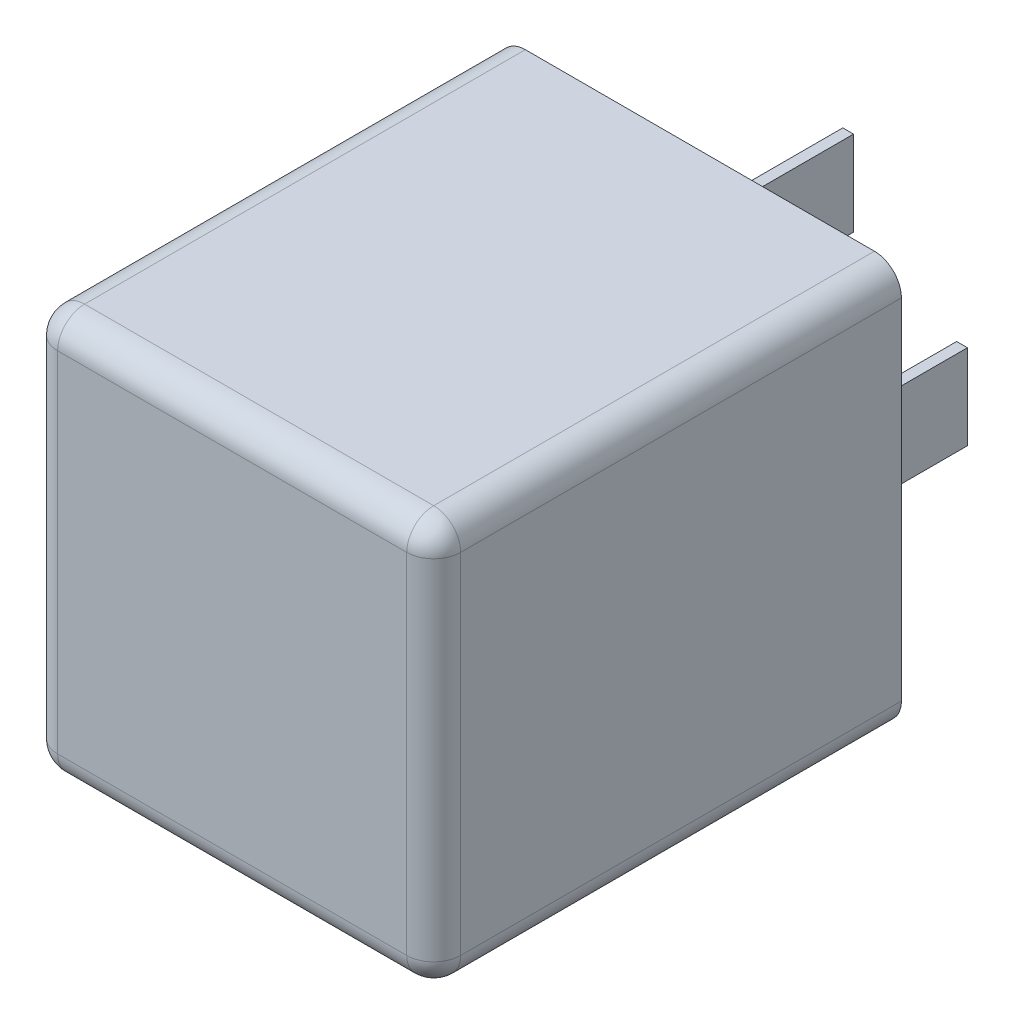
ISO-10303-21;
HEADER;
FILE_DESCRIPTION(('STEP AP214'),'2;1');
FILE_NAME('part.step','',(''),(''),'','','');
FILE_SCHEMA(('AUTOMOTIVE_DESIGN { 1 0 10303 214 1 1 1 1 }'));
ENDSEC;
DATA;
#1=APPLICATION_CONTEXT('core data for automotive mechanical design processes');
#2=APPLICATION_PROTOCOL_DEFINITION('international standard','automotive_design',2000,#1);
#3=PRODUCT_CONTEXT('',#1,'mechanical');
#4=PRODUCT('Part','Part','',(#3));
#5=PRODUCT_RELATED_PRODUCT_CATEGORY('part','',(#4));
#6=PRODUCT_DEFINITION_FORMATION('','',#4);
#7=PRODUCT_DEFINITION_CONTEXT('part definition',#1,'design');
#8=PRODUCT_DEFINITION('design','',#6,#7);
#9=PRODUCT_DEFINITION_SHAPE('','',#8);
#10=(LENGTH_UNIT() NAMED_UNIT(*) SI_UNIT(.MILLI.,.METRE.));
#11=(NAMED_UNIT(*) PLANE_ANGLE_UNIT() SI_UNIT($,.RADIAN.));
#12=(NAMED_UNIT(*) SI_UNIT($,.STERADIAN.) SOLID_ANGLE_UNIT());
#13=UNCERTAINTY_MEASURE_WITH_UNIT(LENGTH_MEASURE(1.E-05),#10,'distance_accuracy_value','');
#14=(GEOMETRIC_REPRESENTATION_CONTEXT(3) GLOBAL_UNCERTAINTY_ASSIGNED_CONTEXT((#13)) GLOBAL_UNIT_ASSIGNED_CONTEXT((#10,
#11,#12)) REPRESENTATION_CONTEXT('',''));
#15=CARTESIAN_POINT('',(0.,0.,0.));
#16=DIRECTION('',(0.,0.,1.));
#17=DIRECTION('',(1.,0.,0.));
#18=AXIS2_PLACEMENT_3D('',#15,#16,#17);
#19=CARTESIAN_POINT('',(12.95,12.95,-2.));
#20=DIRECTION('',(0.707106781186398,0.707106781186698,0.));
#21=DIRECTION('',(0.,0.,1.));
#22=AXIS2_PLACEMENT_3D('',#19,#20,#21);
#23=SPHERICAL_SURFACE('',#22,2.);
#24=CARTESIAN_POINT('',(12.95,12.95,-2.));
#25=DIRECTION('',(0.,0.,1.));
#26=DIRECTION('',(1.,0.,0.));
#27=AXIS2_PLACEMENT_3D('',#24,#25,#26);
#28=CIRCLE('',#27,2.);
#29=CARTESIAN_POINT('',(14.95,12.95,-2.));
#30=VERTEX_POINT('',#29);
#31=CARTESIAN_POINT('',(14.3642135623728,14.3642135623734,-2.));
#32=VERTEX_POINT('',#31);
#33=EDGE_CURVE('E19',#30,#32,#28,.T.);
#34=ORIENTED_EDGE('',*,*,#33,.T.);
#35=CARTESIAN_POINT('',(12.95,12.95,-2.));
#36=DIRECTION('',(0.,0.,1.));
#37=DIRECTION('',(0.707106781186398,0.707106781186698,0.));
#38=AXIS2_PLACEMENT_3D('',#35,#36,#37);
#39=CIRCLE('',#38,2.);
#40=CARTESIAN_POINT('',(12.95,14.95,-2.));
#41=VERTEX_POINT('',#40);
#42=EDGE_CURVE('E205',#32,#41,#39,.T.);
#43=ORIENTED_EDGE('',*,*,#42,.T.);
#44=CARTESIAN_POINT('',(12.95,12.95,-2.));
#45=DIRECTION('',(-1.,0.,0.));
#46=DIRECTION('',(0.,0.,1.));
#47=AXIS2_PLACEMENT_3D('',#44,#45,#46);
#48=CIRCLE('',#47,2.);
#49=CARTESIAN_POINT('',(12.95,12.95,0.));
#50=VERTEX_POINT('',#49);
#51=EDGE_CURVE('E211',#50,#41,#48,.T.);
#52=ORIENTED_EDGE('',*,*,#51,.F.);
#53=CARTESIAN_POINT('',(12.95,12.95,-2.));
#54=DIRECTION('',(0.,1.,0.));
#55=DIRECTION('',(0.,0.,1.));
#56=AXIS2_PLACEMENT_3D('',#53,#54,#55);
#57=CIRCLE('',#56,2.);
#58=EDGE_CURVE('E208',#30,#50,#57,.F.);
#59=ORIENTED_EDGE('',*,*,#58,.F.);
#60=EDGE_LOOP('',(#34,#43,#52,#59));
#61=FACE_BOUND('',#60,.T.);
#62=ADVANCED_FACE('F15',(#61),#23,.T.);
#63=CARTESIAN_POINT('',(-12.95,12.95,-2.));
#64=DIRECTION('',(-0.707106781186698,0.707106781186398,0.));
#65=DIRECTION('',(0.,0.,1.));
#66=AXIS2_PLACEMENT_3D('',#63,#64,#65);
#67=SPHERICAL_SURFACE('',#66,2.);
#68=CARTESIAN_POINT('',(-12.95,12.95,-2.));
#69=DIRECTION('',(0.,0.,1.));
#70=DIRECTION('',(1.,0.,0.));
#71=AXIS2_PLACEMENT_3D('',#68,#69,#70);
#72=CIRCLE('',#71,2.);
#73=CARTESIAN_POINT('',(-12.95,14.95,-2.));
#74=VERTEX_POINT('',#73);
#75=CARTESIAN_POINT('',(-14.3642135623734,14.3642135623728,-2.));
#76=VERTEX_POINT('',#75);
#77=EDGE_CURVE('E314',#74,#76,#72,.T.);
#78=ORIENTED_EDGE('',*,*,#77,.T.);
#79=CARTESIAN_POINT('',(-12.95,12.95,-2.));
#80=DIRECTION('',(0.,0.,1.));
#81=DIRECTION('',(-0.707106781186698,0.707106781186398,0.));
#82=AXIS2_PLACEMENT_3D('',#79,#80,#81);
#83=CIRCLE('',#82,2.);
#84=CARTESIAN_POINT('',(-14.95,12.95,-2.));
#85=VERTEX_POINT('',#84);
#86=EDGE_CURVE('E312',#76,#85,#83,.T.);
#87=ORIENTED_EDGE('',*,*,#86,.T.);
#88=CARTESIAN_POINT('',(-12.95,12.95,-2.));
#89=DIRECTION('',(0.,-1.,0.));
#90=DIRECTION('',(0.,0.,-1.));
#91=AXIS2_PLACEMENT_3D('',#88,#89,#90);
#92=CIRCLE('',#91,2.);
#93=CARTESIAN_POINT('',(-12.95,12.95,0.));
#94=VERTEX_POINT('',#93);
#95=EDGE_CURVE('E316',#94,#85,#92,.T.);
#96=ORIENTED_EDGE('',*,*,#95,.F.);
#97=CARTESIAN_POINT('',(-12.95,12.95,-2.));
#98=DIRECTION('',(-1.,0.,0.));
#99=DIRECTION('',(0.,0.,1.));
#100=AXIS2_PLACEMENT_3D('',#97,#98,#99);
#101=CIRCLE('',#100,2.);
#102=EDGE_CURVE('E317',#74,#94,#101,.F.);
#103=ORIENTED_EDGE('',*,*,#102,.F.);
#104=EDGE_LOOP('',(#78,#87,#96,#103));
#105=FACE_BOUND('',#104,.T.);
#106=ADVANCED_FACE('F297',(#105),#67,.T.);
#107=CARTESIAN_POINT('',(-12.95,-12.95,-2.));
#108=DIRECTION('',(-0.707106781186398,-0.707106781186698,0.));
#109=DIRECTION('',(0.,0.,1.));
#110=AXIS2_PLACEMENT_3D('',#107,#108,#109);
#111=SPHERICAL_SURFACE('',#110,2.);
#112=CARTESIAN_POINT('',(-12.95,-12.95,-2.));
#113=DIRECTION('',(0.,0.,1.));
#114=DIRECTION('',(1.,0.,0.));
#115=AXIS2_PLACEMENT_3D('',#112,#113,#114);
#116=CIRCLE('',#115,2.);
#117=CARTESIAN_POINT('',(-14.95,-12.95,-2.));
#118=VERTEX_POINT('',#117);
#119=CARTESIAN_POINT('',(-14.3642135623728,-14.3642135623734,-2.));
#120=VERTEX_POINT('',#119);
#121=EDGE_CURVE('E305',#118,#120,#116,.T.);
#122=ORIENTED_EDGE('',*,*,#121,.T.);
#123=CARTESIAN_POINT('',(-12.95,-12.95,-2.));
#124=DIRECTION('',(0.,0.,1.));
#125=DIRECTION('',(-0.707106781186398,-0.707106781186698,0.));
#126=AXIS2_PLACEMENT_3D('',#123,#124,#125);
#127=CIRCLE('',#126,2.);
#128=CARTESIAN_POINT('',(-12.95,-14.95,-2.));
#129=VERTEX_POINT('',#128);
#130=EDGE_CURVE('E302',#120,#129,#127,.T.);
#131=ORIENTED_EDGE('',*,*,#130,.T.);
#132=CARTESIAN_POINT('',(-12.95,-12.95,-2.));
#133=DIRECTION('',(1.,0.,0.));
#134=DIRECTION('',(0.,0.,-1.));
#135=AXIS2_PLACEMENT_3D('',#132,#133,#134);
#136=CIRCLE('',#135,2.);
#137=CARTESIAN_POINT('',(-12.95,-12.95,0.));
#138=VERTEX_POINT('',#137);
#139=EDGE_CURVE('E308',#138,#129,#136,.T.);
#140=ORIENTED_EDGE('',*,*,#139,.F.);
#141=CARTESIAN_POINT('',(-12.95,-12.95,-2.));
#142=DIRECTION('',(0.,-1.,0.));
#143=DIRECTION('',(0.,0.,-1.));
#144=AXIS2_PLACEMENT_3D('',#141,#142,#143);
#145=CIRCLE('',#144,2.);
#146=EDGE_CURVE('E309',#118,#138,#145,.F.);
#147=ORIENTED_EDGE('',*,*,#146,.F.);
#148=EDGE_LOOP('',(#122,#131,#140,#147));
#149=FACE_BOUND('',#148,.T.);
#150=ADVANCED_FACE('F292',(#149),#111,.T.);
#151=CARTESIAN_POINT('',(12.95,-12.95,-2.));
#152=DIRECTION('',(0.707106781186698,-0.707106781186398,0.));
#153=DIRECTION('',(0.,0.,1.));
#154=AXIS2_PLACEMENT_3D('',#151,#152,#153);
#155=SPHERICAL_SURFACE('',#154,2.);
#156=CARTESIAN_POINT('',(12.95,-12.95,-2.));
#157=DIRECTION('',(0.,0.,1.));
#158=DIRECTION('',(1.,0.,0.));
#159=AXIS2_PLACEMENT_3D('',#156,#157,#158);
#160=CIRCLE('',#159,2.);
#161=CARTESIAN_POINT('',(12.95,-14.95,-2.));
#162=VERTEX_POINT('',#161);
#163=CARTESIAN_POINT('',(14.3642135623734,-14.3642135623728,-2.));
#164=VERTEX_POINT('',#163);
#165=EDGE_CURVE('E304',#162,#164,#160,.T.);
#166=ORIENTED_EDGE('',*,*,#165,.T.);
#167=CARTESIAN_POINT('',(12.95,-12.95,-2.));
#168=DIRECTION('',(0.,0.,1.));
#169=DIRECTION('',(0.707106781186698,-0.707106781186398,0.));
#170=AXIS2_PLACEMENT_3D('',#167,#168,#169);
#171=CIRCLE('',#170,2.);
#172=CARTESIAN_POINT('',(14.95,-12.95,-2.));
#173=VERTEX_POINT('',#172);
#174=EDGE_CURVE('E284',#164,#173,#171,.T.);
#175=ORIENTED_EDGE('',*,*,#174,.T.);
#176=CARTESIAN_POINT('',(12.95,-12.95,-2.));
#177=DIRECTION('',(0.,1.,0.));
#178=DIRECTION('',(0.,0.,1.));
#179=AXIS2_PLACEMENT_3D('',#176,#177,#178);
#180=CIRCLE('',#179,2.);
#181=CARTESIAN_POINT('',(12.95,-12.95,0.));
#182=VERTEX_POINT('',#181);
#183=EDGE_CURVE('E215',#182,#173,#180,.T.);
#184=ORIENTED_EDGE('',*,*,#183,.F.);
#185=CARTESIAN_POINT('',(12.95,-12.95,-2.));
#186=DIRECTION('',(1.,0.,0.));
#187=DIRECTION('',(0.,0.,-1.));
#188=AXIS2_PLACEMENT_3D('',#185,#186,#187);
#189=CIRCLE('',#188,2.);
#190=EDGE_CURVE('E337',#162,#182,#189,.F.);
#191=ORIENTED_EDGE('',*,*,#190,.F.);
#192=EDGE_LOOP('',(#166,#175,#184,#191));
#193=FACE_BOUND('',#192,.T.);
#194=ADVANCED_FACE('F287',(#193),#155,.T.);
#195=CARTESIAN_POINT('',(0.,0.,0.));
#196=DIRECTION('',(0.,0.,1.));
#197=DIRECTION('',(1.,0.,0.));
#198=AXIS2_PLACEMENT_3D('',#195,#196,#197);
#199=PLANE('',#198);
#200=DIRECTION('',(1.,0.,0.));
#201=VECTOR('',#200,1.);
#202=CARTESIAN_POINT('',(-12.9653768,-12.95,0.));
#203=LINE('',#202,#201);
#204=EDGE_CURVE('E268',#182,#138,#203,.F.);
#205=ORIENTED_EDGE('',*,*,#204,.F.);
#206=DIRECTION('',(0.,1.,0.));
#207=VECTOR('',#206,1.);
#208=CARTESIAN_POINT('',(12.95,-12.9653768,0.));
#209=LINE('',#208,#207);
#210=EDGE_CURVE('E214',#50,#182,#209,.F.);
#211=ORIENTED_EDGE('',*,*,#210,.F.);
#212=DIRECTION('',(-1.,0.,0.));
#213=VECTOR('',#212,1.);
#214=CARTESIAN_POINT('',(12.9653768,12.95,0.));
#215=LINE('',#214,#213);
#216=EDGE_CURVE('E315',#94,#50,#215,.F.);
#217=ORIENTED_EDGE('',*,*,#216,.F.);
#218=DIRECTION('',(0.,-1.,0.));
#219=VECTOR('',#218,1.);
#220=CARTESIAN_POINT('',(-12.95,12.9653768,0.));
#221=LINE('',#220,#219);
#222=EDGE_CURVE('E306',#138,#94,#221,.F.);
#223=ORIENTED_EDGE('',*,*,#222,.F.);
#224=EDGE_LOOP('',(#205,#211,#217,#223));
#225=FACE_BOUND('',#224,.T.);
#226=ADVANCED_FACE('F291',(#225),#199,.T.);
#227=CARTESIAN_POINT('',(12.95,-12.9653768,-2.));
#228=DIRECTION('',(0.,1.,0.));
#229=DIRECTION('',(0.,0.,1.));
#230=AXIS2_PLACEMENT_3D('',#227,#228,#229);
#231=CYLINDRICAL_SURFACE('',#230,2.);
#232=ORIENTED_EDGE('',*,*,#58,.T.);
#233=ORIENTED_EDGE('',*,*,#210,.T.);
#234=ORIENTED_EDGE('',*,*,#183,.T.);
#235=DIRECTION('',(0.,1.,0.));
#236=VECTOR('',#235,1.);
#237=CARTESIAN_POINT('',(14.95,-12.95,-2.));
#238=LINE('',#237,#236);
#239=EDGE_CURVE('E219',#30,#173,#238,.F.);
#240=ORIENTED_EDGE('',*,*,#239,.F.);
#241=EDGE_LOOP('',(#232,#233,#234,#240));
#242=FACE_BOUND('',#241,.T.);
#243=ADVANCED_FACE('F220',(#242),#231,.T.);
#244=CARTESIAN_POINT('',(12.9653768,12.95,-2.));
#245=DIRECTION('',(-1.,0.,0.));
#246=DIRECTION('',(0.,0.,1.));
#247=AXIS2_PLACEMENT_3D('',#244,#245,#246);
#248=CYLINDRICAL_SURFACE('',#247,2.);
#249=ORIENTED_EDGE('',*,*,#102,.T.);
#250=ORIENTED_EDGE('',*,*,#216,.T.);
#251=ORIENTED_EDGE('',*,*,#51,.T.);
#252=DIRECTION('',(1.,0.,0.));
#253=VECTOR('',#252,1.);
#254=CARTESIAN_POINT('',(12.95,14.95,-2.));
#255=LINE('',#254,#253);
#256=EDGE_CURVE('E232',#74,#41,#255,.T.);
#257=ORIENTED_EDGE('',*,*,#256,.F.);
#258=EDGE_LOOP('',(#249,#250,#251,#257));
#259=FACE_BOUND('',#258,.T.);
#260=ADVANCED_FACE('F582',(#259),#248,.T.);
#261=CARTESIAN_POINT('',(-12.95,12.9653768,-2.));
#262=DIRECTION('',(0.,-1.,0.));
#263=DIRECTION('',(0.,0.,-1.));
#264=AXIS2_PLACEMENT_3D('',#261,#262,#263);
#265=CYLINDRICAL_SURFACE('',#264,2.);
#266=ORIENTED_EDGE('',*,*,#146,.T.);
#267=ORIENTED_EDGE('',*,*,#222,.T.);
#268=ORIENTED_EDGE('',*,*,#95,.T.);
#269=DIRECTION('',(0.,1.,0.));
#270=VECTOR('',#269,1.);
#271=CARTESIAN_POINT('',(-14.95,12.95,-2.));
#272=LINE('',#271,#270);
#273=EDGE_CURVE('E274',#118,#85,#272,.T.);
#274=ORIENTED_EDGE('',*,*,#273,.F.);
#275=EDGE_LOOP('',(#266,#267,#268,#274));
#276=FACE_BOUND('',#275,.T.);
#277=ADVANCED_FACE('F578',(#276),#265,.T.);
#278=CARTESIAN_POINT('',(-12.9653768,-12.95,-2.));
#279=DIRECTION('',(1.,0.,0.));
#280=DIRECTION('',(0.,0.,-1.));
#281=AXIS2_PLACEMENT_3D('',#278,#279,#280);
#282=CYLINDRICAL_SURFACE('',#281,2.);
#283=ORIENTED_EDGE('',*,*,#190,.T.);
#284=ORIENTED_EDGE('',*,*,#204,.T.);
#285=ORIENTED_EDGE('',*,*,#139,.T.);
#286=DIRECTION('',(1.,0.,0.));
#287=VECTOR('',#286,1.);
#288=CARTESIAN_POINT('',(-12.95,-14.95,-2.));
#289=LINE('',#288,#287);
#290=EDGE_CURVE('E269',#162,#129,#289,.F.);
#291=ORIENTED_EDGE('',*,*,#290,.F.);
#292=EDGE_LOOP('',(#283,#284,#285,#291));
#293=FACE_BOUND('',#292,.T.);
#294=ADVANCED_FACE('F574',(#293),#282,.T.);
#295=CARTESIAN_POINT('',(-3.15,-10.745,-34.7));
#296=DIRECTION('',(-1.,0.,0.));
#297=DIRECTION('',(0.,0.,1.));
#298=AXIS2_PLACEMENT_3D('',#295,#296,#297);
#299=PLANE('',#298);
#300=DIRECTION('',(0.,0.,-1.));
#301=VECTOR('',#300,1.);
#302=CARTESIAN_POINT('',(-3.15,-10.745,-34.7));
#303=LINE('',#302,#301);
#304=CARTESIAN_POINT('',(-3.15,-10.745,-34.7));
#305=VERTEX_POINT('',#304);
#306=CARTESIAN_POINT('',(-3.15,-10.745,-45.7));
#307=VERTEX_POINT('',#306);
#308=EDGE_CURVE('E376',#305,#307,#303,.T.);
#309=ORIENTED_EDGE('',*,*,#308,.F.);
#310=DIRECTION('',(0.,1.,0.));
#311=VECTOR('',#310,1.);
#312=CARTESIAN_POINT('',(-3.15,-10.745,-34.7));
#313=LINE('',#312,#311);
#314=CARTESIAN_POINT('',(-3.15,-9.955,-34.7));
#315=VERTEX_POINT('',#314);
#316=EDGE_CURVE('E266',#305,#315,#313,.T.);
#317=ORIENTED_EDGE('',*,*,#316,.T.);
#318=DIRECTION('',(0.,0.,1.));
#319=VECTOR('',#318,1.);
#320=CARTESIAN_POINT('',(-3.15,-9.955,-34.7));
#321=LINE('',#320,#319);
#322=CARTESIAN_POINT('',(-3.15,-9.955,-45.7));
#323=VERTEX_POINT('',#322);
#324=EDGE_CURVE('E373',#323,#315,#321,.T.);
#325=ORIENTED_EDGE('',*,*,#324,.F.);
#326=DIRECTION('',(0.,1.,0.));
#327=VECTOR('',#326,1.);
#328=CARTESIAN_POINT('',(-3.15,0.,-45.7));
#329=LINE('',#328,#327);
#330=EDGE_CURVE('E264',#307,#323,#329,.T.);
#331=ORIENTED_EDGE('',*,*,#330,.F.);
#332=EDGE_LOOP('',(#309,#317,#325,#331));
#333=FACE_BOUND('',#332,.T.);
#334=ADVANCED_FACE('F570',(#333),#299,.T.);
#335=CARTESIAN_POINT('',(0.,0.,-45.7));
#336=DIRECTION('',(0.,0.,-1.));
#337=DIRECTION('',(-1.,0.,0.));
#338=AXIS2_PLACEMENT_3D('',#335,#336,#337);
#339=PLANE('',#338);
#340=DIRECTION('',(1.,0.,0.));
#341=VECTOR('',#340,1.);
#342=CARTESIAN_POINT('',(3.15,-10.745,-45.7));
#343=LINE('',#342,#341);
#344=CARTESIAN_POINT('',(3.15,-10.745,-45.7));
#345=VERTEX_POINT('',#344);
#346=EDGE_CURVE('E378',#307,#345,#343,.T.);
#347=ORIENTED_EDGE('',*,*,#346,.F.);
#348=ORIENTED_EDGE('',*,*,#330,.T.);
#349=DIRECTION('',(1.,0.,0.));
#350=VECTOR('',#349,1.);
#351=CARTESIAN_POINT('',(-3.15,-9.955,-45.7));
#352=LINE('',#351,#350);
#353=CARTESIAN_POINT('',(3.15,-9.955,-45.7));
#354=VERTEX_POINT('',#353);
#355=EDGE_CURVE('E370',#354,#323,#352,.F.);
#356=ORIENTED_EDGE('',*,*,#355,.F.);
#357=DIRECTION('',(0.,1.,0.));
#358=VECTOR('',#357,1.);
#359=CARTESIAN_POINT('',(3.15,-9.955,-45.7));
#360=LINE('',#359,#358);
#361=EDGE_CURVE('E262',#345,#354,#360,.T.);
#362=ORIENTED_EDGE('',*,*,#361,.F.);
#363=EDGE_LOOP('',(#347,#348,#356,#362));
#364=FACE_BOUND('',#363,.T.);
#365=ADVANCED_FACE('F566',(#364),#339,.T.);
#366=CARTESIAN_POINT('',(3.15,-9.955,-34.7));
#367=DIRECTION('',(1.,0.,0.));
#368=DIRECTION('',(0.,0.,-1.));
#369=AXIS2_PLACEMENT_3D('',#366,#367,#368);
#370=PLANE('',#369);
#371=DIRECTION('',(0.,0.,1.));
#372=VECTOR('',#371,1.);
#373=CARTESIAN_POINT('',(3.15,-9.955,-34.7));
#374=LINE('',#373,#372);
#375=CARTESIAN_POINT('',(3.15,-9.955,-34.7));
#376=VERTEX_POINT('',#375);
#377=EDGE_CURVE('E272',#376,#354,#374,.F.);
#378=ORIENTED_EDGE('',*,*,#377,.F.);
#379=DIRECTION('',(0.,1.,0.));
#380=VECTOR('',#379,1.);
#381=CARTESIAN_POINT('',(3.15,-9.955,-34.7));
#382=LINE('',#381,#380);
#383=CARTESIAN_POINT('',(3.15,-10.745,-34.7));
#384=VERTEX_POINT('',#383);
#385=EDGE_CURVE('E260',#376,#384,#382,.F.);
#386=ORIENTED_EDGE('',*,*,#385,.T.);
#387=DIRECTION('',(0.,0.,-1.));
#388=VECTOR('',#387,1.);
#389=CARTESIAN_POINT('',(3.15,-10.745,-34.7));
#390=LINE('',#389,#388);
#391=EDGE_CURVE('E380',#345,#384,#390,.F.);
#392=ORIENTED_EDGE('',*,*,#391,.F.);
#393=ORIENTED_EDGE('',*,*,#361,.T.);
#394=EDGE_LOOP('',(#378,#386,#392,#393));
#395=FACE_BOUND('',#394,.T.);
#396=ADVANCED_FACE('F562',(#395),#370,.T.);
#397=CARTESIAN_POINT('',(0.4,4.4,-34.7));
#398=DIRECTION('',(0.,-1.,0.));
#399=DIRECTION('',(0.,0.,-1.));
#400=AXIS2_PLACEMENT_3D('',#397,#398,#399);
#401=PLANE('',#400);
#402=DIRECTION('',(0.,0.,-1.));
#403=VECTOR('',#402,1.);
#404=CARTESIAN_POINT('',(0.4,4.4,-34.7));
#405=LINE('',#404,#403);
#406=CARTESIAN_POINT('',(0.4,4.4,-34.7));
#407=VERTEX_POINT('',#406);
#408=CARTESIAN_POINT('',(0.4,4.4,-45.7));
#409=VERTEX_POINT('',#408);
#410=EDGE_CURVE('E392',#407,#409,#405,.T.);
#411=ORIENTED_EDGE('',*,*,#410,.F.);
#412=DIRECTION('',(1.,0.,0.));
#413=VECTOR('',#412,1.);
#414=CARTESIAN_POINT('',(0.4,4.4,-34.7));
#415=LINE('',#414,#413);
#416=CARTESIAN_POINT('',(-0.4,4.4,-34.7));
#417=VERTEX_POINT('',#416);
#418=EDGE_CURVE('E258',#407,#417,#415,.F.);
#419=ORIENTED_EDGE('',*,*,#418,.T.);
#420=DIRECTION('',(0.,0.,1.));
#421=VECTOR('',#420,1.);
#422=CARTESIAN_POINT('',(-0.4,4.4,-34.7));
#423=LINE('',#422,#421);
#424=CARTESIAN_POINT('',(-0.4,4.4,-45.7));
#425=VERTEX_POINT('',#424);
#426=EDGE_CURVE('E389',#425,#417,#423,.T.);
#427=ORIENTED_EDGE('',*,*,#426,.F.);
#428=DIRECTION('',(-1.,0.,0.));
#429=VECTOR('',#428,1.);
#430=CARTESIAN_POINT('',(0.,4.4,-45.7));
#431=LINE('',#430,#429);
#432=EDGE_CURVE('E256',#409,#425,#431,.T.);
#433=ORIENTED_EDGE('',*,*,#432,.F.);
#434=EDGE_LOOP('',(#411,#419,#427,#433));
#435=FACE_BOUND('',#434,.T.);
#436=ADVANCED_FACE('F558',(#435),#401,.T.);
#437=CARTESIAN_POINT('',(0.,0.,-45.7));
#438=DIRECTION('',(0.,0.,-1.));
#439=DIRECTION('',(-1.,0.,0.));
#440=AXIS2_PLACEMENT_3D('',#437,#438,#439);
#441=PLANE('',#440);
#442=ORIENTED_EDGE('',*,*,#432,.T.);
#443=DIRECTION('',(0.,1.,0.));
#444=VECTOR('',#443,1.);
#445=CARTESIAN_POINT('',(-0.4,4.4,-45.7));
#446=LINE('',#445,#444);
#447=CARTESIAN_POINT('',(-0.4,10.7,-45.7));
#448=VERTEX_POINT('',#447);
#449=EDGE_CURVE('E386',#448,#425,#446,.F.);
#450=ORIENTED_EDGE('',*,*,#449,.F.);
#451=DIRECTION('',(1.,0.,0.));
#452=VECTOR('',#451,1.);
#453=CARTESIAN_POINT('',(-0.4,10.7,-45.7));
#454=LINE('',#453,#452);
#455=CARTESIAN_POINT('',(0.4,10.7,-45.7));
#456=VERTEX_POINT('',#455);
#457=EDGE_CURVE('E254',#456,#448,#454,.F.);
#458=ORIENTED_EDGE('',*,*,#457,.F.);
#459=DIRECTION('',(0.,1.,0.));
#460=VECTOR('',#459,1.);
#461=CARTESIAN_POINT('',(0.4,10.7,-45.7));
#462=LINE('',#461,#460);
#463=EDGE_CURVE('E394',#409,#456,#462,.T.);
#464=ORIENTED_EDGE('',*,*,#463,.F.);
#465=EDGE_LOOP('',(#442,#450,#458,#464));
#466=FACE_BOUND('',#465,.T.);
#467=ADVANCED_FACE('F554',(#466),#441,.T.);
#468=CARTESIAN_POINT('',(-0.4,10.7,-34.7));
#469=DIRECTION('',(0.,1.,0.));
#470=DIRECTION('',(0.,0.,1.));
#471=AXIS2_PLACEMENT_3D('',#468,#469,#470);
#472=PLANE('',#471);
#473=DIRECTION('',(0.,0.,1.));
#474=VECTOR('',#473,1.);
#475=CARTESIAN_POINT('',(-0.4,10.7,-34.7));
#476=LINE('',#475,#474);
#477=CARTESIAN_POINT('',(-0.4,10.7,-34.7));
#478=VERTEX_POINT('',#477);
#479=EDGE_CURVE('E383',#478,#448,#476,.F.);
#480=ORIENTED_EDGE('',*,*,#479,.F.);
#481=DIRECTION('',(1.,0.,0.));
#482=VECTOR('',#481,1.);
#483=CARTESIAN_POINT('',(-0.4,10.7,-34.7));
#484=LINE('',#483,#482);
#485=CARTESIAN_POINT('',(0.4,10.7,-34.7));
#486=VERTEX_POINT('',#485);
#487=EDGE_CURVE('E252',#478,#486,#484,.T.);
#488=ORIENTED_EDGE('',*,*,#487,.T.);
#489=DIRECTION('',(0.,0.,-1.));
#490=VECTOR('',#489,1.);
#491=CARTESIAN_POINT('',(0.4,10.7,-34.7));
#492=LINE('',#491,#490);
#493=EDGE_CURVE('E396',#456,#486,#492,.F.);
#494=ORIENTED_EDGE('',*,*,#493,.F.);
#495=ORIENTED_EDGE('',*,*,#457,.T.);
#496=EDGE_LOOP('',(#480,#488,#494,#495));
#497=FACE_BOUND('',#496,.T.);
#498=ADVANCED_FACE('F550',(#497),#472,.T.);
#499=CARTESIAN_POINT('',(8.85,-5.1,-34.7));
#500=DIRECTION('',(0.,-1.,0.));
#501=DIRECTION('',(0.,0.,-1.));
#502=AXIS2_PLACEMENT_3D('',#499,#500,#501);
#503=PLANE('',#502);
#504=DIRECTION('',(0.,0.,-1.));
#505=VECTOR('',#504,1.);
#506=CARTESIAN_POINT('',(8.85,-5.1,-34.7));
#507=LINE('',#506,#505);
#508=CARTESIAN_POINT('',(8.85,-5.1,-34.7));
#509=VERTEX_POINT('',#508);
#510=CARTESIAN_POINT('',(8.85,-5.1,-45.7));
#511=VERTEX_POINT('',#510);
#512=EDGE_CURVE('E408',#509,#511,#507,.T.);
#513=ORIENTED_EDGE('',*,*,#512,.F.);
#514=DIRECTION('',(1.,0.,0.));
#515=VECTOR('',#514,1.);
#516=CARTESIAN_POINT('',(8.85,-5.1,-34.7));
#517=LINE('',#516,#515);
#518=CARTESIAN_POINT('',(8.05,-5.1,-34.7));
#519=VERTEX_POINT('',#518);
#520=EDGE_CURVE('E250',#509,#519,#517,.F.);
#521=ORIENTED_EDGE('',*,*,#520,.T.);
#522=DIRECTION('',(0.,0.,1.));
#523=VECTOR('',#522,1.);
#524=CARTESIAN_POINT('',(8.05,-5.1,-34.7));
#525=LINE('',#524,#523);
#526=CARTESIAN_POINT('',(8.05,-5.1,-45.7));
#527=VERTEX_POINT('',#526);
#528=EDGE_CURVE('E405',#527,#519,#525,.T.);
#529=ORIENTED_EDGE('',*,*,#528,.F.);
#530=DIRECTION('',(-1.,0.,0.));
#531=VECTOR('',#530,1.);
#532=CARTESIAN_POINT('',(0.,-5.1,-45.7));
#533=LINE('',#532,#531);
#534=EDGE_CURVE('E248',#511,#527,#533,.T.);
#535=ORIENTED_EDGE('',*,*,#534,.F.);
#536=EDGE_LOOP('',(#513,#521,#529,#535));
#537=FACE_BOUND('',#536,.T.);
#538=ADVANCED_FACE('F546',(#537),#503,.T.);
#539=CARTESIAN_POINT('',(0.,0.,-45.7));
#540=DIRECTION('',(0.,0.,-1.));
#541=DIRECTION('',(-1.,0.,0.));
#542=AXIS2_PLACEMENT_3D('',#539,#540,#541);
#543=PLANE('',#542);
#544=ORIENTED_EDGE('',*,*,#534,.T.);
#545=DIRECTION('',(0.,1.,0.));
#546=VECTOR('',#545,1.);
#547=CARTESIAN_POINT('',(8.05,-5.1,-45.7));
#548=LINE('',#547,#546);
#549=CARTESIAN_POINT('',(8.05,1.2,-45.7));
#550=VERTEX_POINT('',#549);
#551=EDGE_CURVE('E402',#550,#527,#548,.F.);
#552=ORIENTED_EDGE('',*,*,#551,.F.);
#553=DIRECTION('',(1.,0.,0.));
#554=VECTOR('',#553,1.);
#555=CARTESIAN_POINT('',(8.05,1.2,-45.7));
#556=LINE('',#555,#554);
#557=CARTESIAN_POINT('',(8.85,1.2,-45.7));
#558=VERTEX_POINT('',#557);
#559=EDGE_CURVE('E246',#558,#550,#556,.F.);
#560=ORIENTED_EDGE('',*,*,#559,.F.);
#561=DIRECTION('',(0.,1.,0.));
#562=VECTOR('',#561,1.);
#563=CARTESIAN_POINT('',(8.85,1.2,-45.7));
#564=LINE('',#563,#562);
#565=EDGE_CURVE('E410',#511,#558,#564,.T.);
#566=ORIENTED_EDGE('',*,*,#565,.F.);
#567=EDGE_LOOP('',(#544,#552,#560,#566));
#568=FACE_BOUND('',#567,.T.);
#569=ADVANCED_FACE('F542',(#568),#543,.T.);
#570=CARTESIAN_POINT('',(8.05,1.2,-34.7));
#571=DIRECTION('',(0.,1.,0.));
#572=DIRECTION('',(0.,0.,1.));
#573=AXIS2_PLACEMENT_3D('',#570,#571,#572);
#574=PLANE('',#573);
#575=DIRECTION('',(0.,0.,1.));
#576=VECTOR('',#575,1.);
#577=CARTESIAN_POINT('',(8.05,1.2,-34.7));
#578=LINE('',#577,#576);
#579=CARTESIAN_POINT('',(8.05,1.2,-34.7));
#580=VERTEX_POINT('',#579);
#581=EDGE_CURVE('E399',#580,#550,#578,.F.);
#582=ORIENTED_EDGE('',*,*,#581,.F.);
#583=DIRECTION('',(1.,0.,0.));
#584=VECTOR('',#583,1.);
#585=CARTESIAN_POINT('',(8.05,1.2,-34.7));
#586=LINE('',#585,#584);
#587=CARTESIAN_POINT('',(8.85,1.2,-34.7));
#588=VERTEX_POINT('',#587);
#589=EDGE_CURVE('E244',#580,#588,#586,.T.);
#590=ORIENTED_EDGE('',*,*,#589,.T.);
#591=DIRECTION('',(0.,0.,-1.));
#592=VECTOR('',#591,1.);
#593=CARTESIAN_POINT('',(8.85,1.2,-34.7));
#594=LINE('',#593,#592);
#595=EDGE_CURVE('E412',#558,#588,#594,.F.);
#596=ORIENTED_EDGE('',*,*,#595,.F.);
#597=ORIENTED_EDGE('',*,*,#559,.T.);
#598=EDGE_LOOP('',(#582,#590,#596,#597));
#599=FACE_BOUND('',#598,.T.);
#600=ADVANCED_FACE('F539',(#599),#574,.T.);
#601=CARTESIAN_POINT('',(-8.05,-5.1,-34.7));
#602=DIRECTION('',(0.,-1.,0.));
#603=DIRECTION('',(0.,0.,-1.));
#604=AXIS2_PLACEMENT_3D('',#601,#602,#603);
#605=PLANE('',#604);
#606=DIRECTION('',(0.,0.,-1.));
#607=VECTOR('',#606,1.);
#608=CARTESIAN_POINT('',(-8.05,-5.1,-34.7));
#609=LINE('',#608,#607);
#610=CARTESIAN_POINT('',(-8.05,-5.1,-34.7));
#611=VERTEX_POINT('',#610);
#612=CARTESIAN_POINT('',(-8.05,-5.1,-45.7));
#613=VERTEX_POINT('',#612);
#614=EDGE_CURVE('E424',#611,#613,#609,.T.);
#615=ORIENTED_EDGE('',*,*,#614,.F.);
#616=DIRECTION('',(1.,0.,0.));
#617=VECTOR('',#616,1.);
#618=CARTESIAN_POINT('',(-8.05,-5.1,-34.7));
#619=LINE('',#618,#617);
#620=CARTESIAN_POINT('',(-8.85,-5.1,-34.7));
#621=VERTEX_POINT('',#620);
#622=EDGE_CURVE('E242',#611,#621,#619,.F.);
#623=ORIENTED_EDGE('',*,*,#622,.T.);
#624=DIRECTION('',(0.,0.,1.));
#625=VECTOR('',#624,1.);
#626=CARTESIAN_POINT('',(-8.85,-5.1,-34.7));
#627=LINE('',#626,#625);
#628=CARTESIAN_POINT('',(-8.85,-5.1,-45.7));
#629=VERTEX_POINT('',#628);
#630=EDGE_CURVE('E421',#629,#621,#627,.T.);
#631=ORIENTED_EDGE('',*,*,#630,.F.);
#632=DIRECTION('',(-1.,0.,0.));
#633=VECTOR('',#632,1.);
#634=CARTESIAN_POINT('',(0.,-5.1,-45.7));
#635=LINE('',#634,#633);
#636=EDGE_CURVE('E240',#613,#629,#635,.T.);
#637=ORIENTED_EDGE('',*,*,#636,.F.);
#638=EDGE_LOOP('',(#615,#623,#631,#637));
#639=FACE_BOUND('',#638,.T.);
#640=ADVANCED_FACE('F471',(#639),#605,.T.);
#641=CARTESIAN_POINT('',(0.,0.,-45.7));
#642=DIRECTION('',(0.,0.,-1.));
#643=DIRECTION('',(-1.,0.,0.));
#644=AXIS2_PLACEMENT_3D('',#641,#642,#643);
#645=PLANE('',#644);
#646=DIRECTION('',(0.,1.,0.));
#647=VECTOR('',#646,1.);
#648=CARTESIAN_POINT('',(-8.05,1.2,-45.7));
#649=LINE('',#648,#647);
#650=CARTESIAN_POINT('',(-8.05,1.2,-45.7));
#651=VERTEX_POINT('',#650);
#652=EDGE_CURVE('E426',#613,#651,#649,.T.);
#653=ORIENTED_EDGE('',*,*,#652,.F.);
#654=ORIENTED_EDGE('',*,*,#636,.T.);
#655=DIRECTION('',(0.,1.,0.));
#656=VECTOR('',#655,1.);
#657=CARTESIAN_POINT('',(-8.85,-5.1,-45.7));
#658=LINE('',#657,#656);
#659=CARTESIAN_POINT('',(-8.85,1.2,-45.7));
#660=VERTEX_POINT('',#659);
#661=EDGE_CURVE('E418',#660,#629,#658,.F.);
#662=ORIENTED_EDGE('',*,*,#661,.F.);
#663=DIRECTION('',(1.,0.,0.));
#664=VECTOR('',#663,1.);
#665=CARTESIAN_POINT('',(-8.85,1.2,-45.7));
#666=LINE('',#665,#664);
#667=EDGE_CURVE('E238',#651,#660,#666,.F.);
#668=ORIENTED_EDGE('',*,*,#667,.F.);
#669=EDGE_LOOP('',(#653,#654,#662,#668));
#670=FACE_BOUND('',#669,.T.);
#671=ADVANCED_FACE('F468',(#670),#645,.T.);
#672=CARTESIAN_POINT('',(-8.85,1.2,-34.7));
#673=DIRECTION('',(0.,1.,0.));
#674=DIRECTION('',(0.,0.,1.));
#675=AXIS2_PLACEMENT_3D('',#672,#673,#674);
#676=PLANE('',#675);
#677=DIRECTION('',(0.,0.,1.));
#678=VECTOR('',#677,1.);
#679=CARTESIAN_POINT('',(-8.85,1.2,-34.7));
#680=LINE('',#679,#678);
#681=CARTESIAN_POINT('',(-8.85,1.2,-34.7));
#682=VERTEX_POINT('',#681);
#683=EDGE_CURVE('E415',#682,#660,#680,.F.);
#684=ORIENTED_EDGE('',*,*,#683,.F.);
#685=DIRECTION('',(1.,0.,0.));
#686=VECTOR('',#685,1.);
#687=CARTESIAN_POINT('',(-8.85,1.2,-34.7));
#688=LINE('',#687,#686);
#689=CARTESIAN_POINT('',(-8.05,1.2,-34.7));
#690=VERTEX_POINT('',#689);
#691=EDGE_CURVE('E34',#682,#690,#688,.T.);
#692=ORIENTED_EDGE('',*,*,#691,.T.);
#693=DIRECTION('',(0.,0.,-1.));
#694=VECTOR('',#693,1.);
#695=CARTESIAN_POINT('',(-8.05,1.2,-34.7));
#696=LINE('',#695,#694);
#697=EDGE_CURVE('E336',#651,#690,#696,.F.);
#698=ORIENTED_EDGE('',*,*,#697,.F.);
#699=ORIENTED_EDGE('',*,*,#667,.T.);
#700=EDGE_LOOP('',(#684,#692,#698,#699));
#701=FACE_BOUND('',#700,.T.);
#702=ADVANCED_FACE('F464',(#701),#676,.T.);
#703=CARTESIAN_POINT('',(12.95,-12.95,0.));
#704=DIRECTION('',(0.,0.,1.));
#705=DIRECTION('',(1.,0.,0.));
#706=AXIS2_PLACEMENT_3D('',#703,#704,#705);
#707=CYLINDRICAL_SURFACE('',#706,2.);
#708=DIRECTION('',(0.,0.,-1.));
#709=VECTOR('',#708,1.);
#710=CARTESIAN_POINT('',(14.95,-12.95,0.));
#711=LINE('',#710,#709);
#712=CARTESIAN_POINT('',(14.95,-12.95,-34.7));
#713=VERTEX_POINT('',#712);
#714=EDGE_CURVE('E224',#173,#713,#711,.T.);
#715=ORIENTED_EDGE('',*,*,#714,.F.);
#716=ORIENTED_EDGE('',*,*,#174,.F.);
#717=ORIENTED_EDGE('',*,*,#165,.F.);
#718=DIRECTION('',(0.,0.,-1.));
#719=VECTOR('',#718,1.);
#720=CARTESIAN_POINT('',(12.95,-14.95,0.));
#721=LINE('',#720,#719);
#722=CARTESIAN_POINT('',(12.95,-14.95,-34.7));
#723=VERTEX_POINT('',#722);
#724=EDGE_CURVE('E273',#723,#162,#721,.F.);
#725=ORIENTED_EDGE('',*,*,#724,.F.);
#726=CARTESIAN_POINT('',(12.95,-12.95,-34.7));
#727=DIRECTION('',(0.,0.,1.));
#728=DIRECTION('',(1.,0.,0.));
#729=AXIS2_PLACEMENT_3D('',#726,#727,#728);
#730=CIRCLE('',#729,2.);
#731=EDGE_CURVE('E333',#723,#713,#730,.T.);
#732=ORIENTED_EDGE('',*,*,#731,.T.);
#733=EDGE_LOOP('',(#715,#716,#717,#725,#732));
#734=FACE_BOUND('',#733,.T.);
#735=ADVANCED_FACE('F529',(#734),#707,.T.);
#736=CARTESIAN_POINT('',(14.95,-12.95,0.));
#737=DIRECTION('',(1.,0.,0.));
#738=DIRECTION('',(0.,0.,-1.));
#739=AXIS2_PLACEMENT_3D('',#736,#737,#738);
#740=PLANE('',#739);
#741=DIRECTION('',(0.,0.,1.));
#742=VECTOR('',#741,1.);
#743=CARTESIAN_POINT('',(14.95,12.95,0.));
#744=LINE('',#743,#742);
#745=CARTESIAN_POINT('',(14.95,12.95,-34.7));
#746=VERTEX_POINT('',#745);
#747=EDGE_CURVE('E203',#30,#746,#744,.F.);
#748=ORIENTED_EDGE('',*,*,#747,.F.);
#749=ORIENTED_EDGE('',*,*,#239,.T.);
#750=ORIENTED_EDGE('',*,*,#714,.T.);
#751=DIRECTION('',(0.,1.,0.));
#752=VECTOR('',#751,1.);
#753=CARTESIAN_POINT('',(14.95,0.,-34.7));
#754=LINE('',#753,#752);
#755=EDGE_CURVE('E229',#713,#746,#754,.T.);
#756=ORIENTED_EDGE('',*,*,#755,.T.);
#757=EDGE_LOOP('',(#748,#749,#750,#756));
#758=FACE_BOUND('',#757,.T.);
#759=ADVANCED_FACE('F227',(#758),#740,.T.);
#760=CARTESIAN_POINT('',(12.95,12.95,0.));
#761=DIRECTION('',(0.,0.,1.));
#762=DIRECTION('',(1.,0.,0.));
#763=AXIS2_PLACEMENT_3D('',#760,#761,#762);
#764=CYLINDRICAL_SURFACE('',#763,2.);
#765=DIRECTION('',(0.,0.,1.));
#766=VECTOR('',#765,1.);
#767=CARTESIAN_POINT('',(12.95,14.95,0.));
#768=LINE('',#767,#766);
#769=CARTESIAN_POINT('',(12.95,14.95,-34.7));
#770=VERTEX_POINT('',#769);
#771=EDGE_CURVE('E230',#41,#770,#768,.F.);
#772=ORIENTED_EDGE('',*,*,#771,.F.);
#773=ORIENTED_EDGE('',*,*,#42,.F.);
#774=ORIENTED_EDGE('',*,*,#33,.F.);
#775=ORIENTED_EDGE('',*,*,#747,.T.);
#776=CARTESIAN_POINT('',(12.95,12.95,-34.7));
#777=DIRECTION('',(0.,0.,1.));
#778=DIRECTION('',(1.,0.,0.));
#779=AXIS2_PLACEMENT_3D('',#776,#777,#778);
#780=CIRCLE('',#779,2.);
#781=EDGE_CURVE('E331',#746,#770,#780,.T.);
#782=ORIENTED_EDGE('',*,*,#781,.T.);
#783=EDGE_LOOP('',(#772,#773,#774,#775,#782));
#784=FACE_BOUND('',#783,.T.);
#785=ADVANCED_FACE('F200',(#784),#764,.T.);
#786=CARTESIAN_POINT('',(12.95,14.95,0.));
#787=DIRECTION('',(0.,1.,0.));
#788=DIRECTION('',(0.,0.,1.));
#789=AXIS2_PLACEMENT_3D('',#786,#787,#788);
#790=PLANE('',#789);
#791=DIRECTION('',(0.,0.,1.));
#792=VECTOR('',#791,1.);
#793=CARTESIAN_POINT('',(-12.95,14.95,0.));
#794=LINE('',#793,#792);
#795=CARTESIAN_POINT('',(-12.95,14.95,-34.7));
#796=VERTEX_POINT('',#795);
#797=EDGE_CURVE('E280',#74,#796,#794,.F.);
#798=ORIENTED_EDGE('',*,*,#797,.F.);
#799=ORIENTED_EDGE('',*,*,#256,.T.);
#800=ORIENTED_EDGE('',*,*,#771,.T.);
#801=DIRECTION('',(1.,0.,0.));
#802=VECTOR('',#801,1.);
#803=CARTESIAN_POINT('',(0.,14.95,-34.7));
#804=LINE('',#803,#802);
#805=EDGE_CURVE('E330',#770,#796,#804,.F.);
#806=ORIENTED_EDGE('',*,*,#805,.T.);
#807=EDGE_LOOP('',(#798,#799,#800,#806));
#808=FACE_BOUND('',#807,.T.);
#809=ADVANCED_FACE('F521',(#808),#790,.T.);
#810=CARTESIAN_POINT('',(-12.95,12.95,0.));
#811=DIRECTION('',(0.,0.,1.));
#812=DIRECTION('',(1.,0.,0.));
#813=AXIS2_PLACEMENT_3D('',#810,#811,#812);
#814=CYLINDRICAL_SURFACE('',#813,2.);
#815=DIRECTION('',(0.,0.,1.));
#816=VECTOR('',#815,1.);
#817=CARTESIAN_POINT('',(-14.95,12.95,0.));
#818=LINE('',#817,#816);
#819=CARTESIAN_POINT('',(-14.95,12.95,-34.7));
#820=VERTEX_POINT('',#819);
#821=EDGE_CURVE('E278',#85,#820,#818,.F.);
#822=ORIENTED_EDGE('',*,*,#821,.F.);
#823=ORIENTED_EDGE('',*,*,#86,.F.);
#824=ORIENTED_EDGE('',*,*,#77,.F.);
#825=ORIENTED_EDGE('',*,*,#797,.T.);
#826=CARTESIAN_POINT('',(-12.95,12.95,-34.7));
#827=DIRECTION('',(0.,0.,1.));
#828=DIRECTION('',(1.,0.,0.));
#829=AXIS2_PLACEMENT_3D('',#826,#827,#828);
#830=CIRCLE('',#829,2.);
#831=EDGE_CURVE('E327',#796,#820,#830,.T.);
#832=ORIENTED_EDGE('',*,*,#831,.T.);
#833=EDGE_LOOP('',(#822,#823,#824,#825,#832));
#834=FACE_BOUND('',#833,.T.);
#835=ADVANCED_FACE('F356',(#834),#814,.T.);
#836=CARTESIAN_POINT('',(-14.95,12.95,0.));
#837=DIRECTION('',(-1.,0.,0.));
#838=DIRECTION('',(0.,0.,1.));
#839=AXIS2_PLACEMENT_3D('',#836,#837,#838);
#840=PLANE('',#839);
#841=DIRECTION('',(0.,0.,1.));
#842=VECTOR('',#841,1.);
#843=CARTESIAN_POINT('',(-14.95,-12.95,0.));
#844=LINE('',#843,#842);
#845=CARTESIAN_POINT('',(-14.95,-12.95,-34.7));
#846=VERTEX_POINT('',#845);
#847=EDGE_CURVE('E277',#118,#846,#844,.F.);
#848=ORIENTED_EDGE('',*,*,#847,.F.);
#849=ORIENTED_EDGE('',*,*,#273,.T.);
#850=ORIENTED_EDGE('',*,*,#821,.T.);
#851=DIRECTION('',(0.,1.,0.));
#852=VECTOR('',#851,1.);
#853=CARTESIAN_POINT('',(-14.95,0.,-34.7));
#854=LINE('',#853,#852);
#855=EDGE_CURVE('E326',#820,#846,#854,.F.);
#856=ORIENTED_EDGE('',*,*,#855,.T.);
#857=EDGE_LOOP('',(#848,#849,#850,#856));
#858=FACE_BOUND('',#857,.T.);
#859=ADVANCED_FACE('F515',(#858),#840,.T.);
#860=CARTESIAN_POINT('',(-12.95,-12.95,0.));
#861=DIRECTION('',(0.,0.,1.));
#862=DIRECTION('',(1.,0.,0.));
#863=AXIS2_PLACEMENT_3D('',#860,#861,#862);
#864=CYLINDRICAL_SURFACE('',#863,2.);
#865=DIRECTION('',(0.,0.,-1.));
#866=VECTOR('',#865,1.);
#867=CARTESIAN_POINT('',(-12.95,-14.95,0.));
#868=LINE('',#867,#866);
#869=CARTESIAN_POINT('',(-12.95,-14.95,-34.7));
#870=VERTEX_POINT('',#869);
#871=EDGE_CURVE('E364',#129,#870,#868,.T.);
#872=ORIENTED_EDGE('',*,*,#871,.F.);
#873=ORIENTED_EDGE('',*,*,#130,.F.);
#874=ORIENTED_EDGE('',*,*,#121,.F.);
#875=ORIENTED_EDGE('',*,*,#847,.T.);
#876=CARTESIAN_POINT('',(-12.95,-12.95,-34.7));
#877=DIRECTION('',(0.,0.,1.));
#878=DIRECTION('',(1.,0.,0.));
#879=AXIS2_PLACEMENT_3D('',#876,#877,#878);
#880=CIRCLE('',#879,2.);
#881=EDGE_CURVE('E322',#846,#870,#880,.T.);
#882=ORIENTED_EDGE('',*,*,#881,.T.);
#883=EDGE_LOOP('',(#872,#873,#874,#875,#882));
#884=FACE_BOUND('',#883,.T.);
#885=ADVANCED_FACE('F511',(#884),#864,.T.);
#886=CARTESIAN_POINT('',(-12.95,-14.95,0.));
#887=DIRECTION('',(0.,-1.,0.));
#888=DIRECTION('',(0.,0.,-1.));
#889=AXIS2_PLACEMENT_3D('',#886,#887,#888);
#890=PLANE('',#889);
#891=ORIENTED_EDGE('',*,*,#724,.T.);
#892=ORIENTED_EDGE('',*,*,#290,.T.);
#893=ORIENTED_EDGE('',*,*,#871,.T.);
#894=DIRECTION('',(1.,0.,0.));
#895=VECTOR('',#894,1.);
#896=CARTESIAN_POINT('',(0.,-14.95,-34.7));
#897=LINE('',#896,#895);
#898=EDGE_CURVE('E325',#870,#723,#897,.T.);
#899=ORIENTED_EDGE('',*,*,#898,.T.);
#900=EDGE_LOOP('',(#891,#892,#893,#899));
#901=FACE_BOUND('',#900,.T.);
#902=ADVANCED_FACE('F507',(#901),#890,.T.);
#903=CARTESIAN_POINT('',(-3.15,-9.955,-34.7));
#904=DIRECTION('',(0.,1.,0.));
#905=DIRECTION('',(0.,0.,1.));
#906=AXIS2_PLACEMENT_3D('',#903,#904,#905);
#907=PLANE('',#906);
#908=ORIENTED_EDGE('',*,*,#324,.T.);
#909=DIRECTION('',(1.,0.,0.));
#910=VECTOR('',#909,1.);
#911=CARTESIAN_POINT('',(0.,-9.955,-34.7));
#912=LINE('',#911,#910);
#913=EDGE_CURVE('E435',#315,#376,#912,.T.);
#914=ORIENTED_EDGE('',*,*,#913,.T.);
#915=ORIENTED_EDGE('',*,*,#377,.T.);
#916=ORIENTED_EDGE('',*,*,#355,.T.);
#917=EDGE_LOOP('',(#908,#914,#915,#916));
#918=FACE_BOUND('',#917,.T.);
#919=ADVANCED_FACE('F503',(#918),#907,.T.);
#920=CARTESIAN_POINT('',(3.15,-10.745,-34.7));
#921=DIRECTION('',(0.,-1.,0.));
#922=DIRECTION('',(0.,0.,-1.));
#923=AXIS2_PLACEMENT_3D('',#920,#921,#922);
#924=PLANE('',#923);
#925=ORIENTED_EDGE('',*,*,#391,.T.);
#926=DIRECTION('',(1.,0.,0.));
#927=VECTOR('',#926,1.);
#928=CARTESIAN_POINT('',(0.,-10.745,-34.7));
#929=LINE('',#928,#927);
#930=EDGE_CURVE('E438',#384,#305,#929,.F.);
#931=ORIENTED_EDGE('',*,*,#930,.T.);
#932=ORIENTED_EDGE('',*,*,#308,.T.);
#933=ORIENTED_EDGE('',*,*,#346,.T.);
#934=EDGE_LOOP('',(#925,#931,#932,#933));
#935=FACE_BOUND('',#934,.T.);
#936=ADVANCED_FACE('F499',(#935),#924,.T.);
#937=CARTESIAN_POINT('',(-0.4,4.4,-34.7));
#938=DIRECTION('',(-1.,0.,0.));
#939=DIRECTION('',(0.,0.,1.));
#940=AXIS2_PLACEMENT_3D('',#937,#938,#939);
#941=PLANE('',#940);
#942=ORIENTED_EDGE('',*,*,#426,.T.);
#943=DIRECTION('',(0.,1.,0.));
#944=VECTOR('',#943,1.);
#945=CARTESIAN_POINT('',(-0.4,0.,-34.7));
#946=LINE('',#945,#944);
#947=EDGE_CURVE('E441',#417,#478,#946,.T.);
#948=ORIENTED_EDGE('',*,*,#947,.T.);
#949=ORIENTED_EDGE('',*,*,#479,.T.);
#950=ORIENTED_EDGE('',*,*,#449,.T.);
#951=EDGE_LOOP('',(#942,#948,#949,#950));
#952=FACE_BOUND('',#951,.T.);
#953=ADVANCED_FACE('F495',(#952),#941,.T.);
#954=CARTESIAN_POINT('',(0.4,10.7,-34.7));
#955=DIRECTION('',(1.,0.,0.));
#956=DIRECTION('',(0.,0.,-1.));
#957=AXIS2_PLACEMENT_3D('',#954,#955,#956);
#958=PLANE('',#957);
#959=ORIENTED_EDGE('',*,*,#493,.T.);
#960=DIRECTION('',(0.,1.,0.));
#961=VECTOR('',#960,1.);
#962=CARTESIAN_POINT('',(0.4,0.,-34.7));
#963=LINE('',#962,#961);
#964=EDGE_CURVE('E444',#486,#407,#963,.F.);
#965=ORIENTED_EDGE('',*,*,#964,.T.);
#966=ORIENTED_EDGE('',*,*,#410,.T.);
#967=ORIENTED_EDGE('',*,*,#463,.T.);
#968=EDGE_LOOP('',(#959,#965,#966,#967));
#969=FACE_BOUND('',#968,.T.);
#970=ADVANCED_FACE('F491',(#969),#958,.T.);
#971=CARTESIAN_POINT('',(8.05,-5.1,-34.7));
#972=DIRECTION('',(-1.,0.,0.));
#973=DIRECTION('',(0.,0.,1.));
#974=AXIS2_PLACEMENT_3D('',#971,#972,#973);
#975=PLANE('',#974);
#976=ORIENTED_EDGE('',*,*,#528,.T.);
#977=DIRECTION('',(0.,1.,0.));
#978=VECTOR('',#977,1.);
#979=CARTESIAN_POINT('',(8.05,0.,-34.7));
#980=LINE('',#979,#978);
#981=EDGE_CURVE('E447',#519,#580,#980,.T.);
#982=ORIENTED_EDGE('',*,*,#981,.T.);
#983=ORIENTED_EDGE('',*,*,#581,.T.);
#984=ORIENTED_EDGE('',*,*,#551,.T.);
#985=EDGE_LOOP('',(#976,#982,#983,#984));
#986=FACE_BOUND('',#985,.T.);
#987=ADVANCED_FACE('F487',(#986),#975,.T.);
#988=CARTESIAN_POINT('',(8.85,1.2,-34.7));
#989=DIRECTION('',(1.,0.,0.));
#990=DIRECTION('',(0.,0.,-1.));
#991=AXIS2_PLACEMENT_3D('',#988,#989,#990);
#992=PLANE('',#991);
#993=ORIENTED_EDGE('',*,*,#595,.T.);
#994=DIRECTION('',(0.,1.,0.));
#995=VECTOR('',#994,1.);
#996=CARTESIAN_POINT('',(8.85,0.,-34.7));
#997=LINE('',#996,#995);
#998=EDGE_CURVE('E450',#588,#509,#997,.F.);
#999=ORIENTED_EDGE('',*,*,#998,.T.);
#1000=ORIENTED_EDGE('',*,*,#512,.T.);
#1001=ORIENTED_EDGE('',*,*,#565,.T.);
#1002=EDGE_LOOP('',(#993,#999,#1000,#1001));
#1003=FACE_BOUND('',#1002,.T.);
#1004=ADVANCED_FACE('F482',(#1003),#992,.T.);
#1005=CARTESIAN_POINT('',(-8.85,-5.1,-34.7));
#1006=DIRECTION('',(-1.,0.,0.));
#1007=DIRECTION('',(0.,0.,1.));
#1008=AXIS2_PLACEMENT_3D('',#1005,#1006,#1007);
#1009=PLANE('',#1008);
#1010=ORIENTED_EDGE('',*,*,#630,.T.);
#1011=DIRECTION('',(0.,1.,0.));
#1012=VECTOR('',#1011,1.);
#1013=CARTESIAN_POINT('',(-8.85,0.,-34.7));
#1014=LINE('',#1013,#1012);
#1015=EDGE_CURVE('E25',#621,#682,#1014,.T.);
#1016=ORIENTED_EDGE('',*,*,#1015,.T.);
#1017=ORIENTED_EDGE('',*,*,#683,.T.);
#1018=ORIENTED_EDGE('',*,*,#661,.T.);
#1019=EDGE_LOOP('',(#1010,#1016,#1017,#1018));
#1020=FACE_BOUND('',#1019,.T.);
#1021=ADVANCED_FACE('F456',(#1020),#1009,.T.);
#1022=CARTESIAN_POINT('',(-8.05,1.2,-34.7));
#1023=DIRECTION('',(1.,0.,0.));
#1024=DIRECTION('',(0.,0.,-1.));
#1025=AXIS2_PLACEMENT_3D('',#1022,#1023,#1024);
#1026=PLANE('',#1025);
#1027=ORIENTED_EDGE('',*,*,#697,.T.);
#1028=DIRECTION('',(0.,1.,0.));
#1029=VECTOR('',#1028,1.);
#1030=CARTESIAN_POINT('',(-8.05,0.,-34.7));
#1031=LINE('',#1030,#1029);
#1032=EDGE_CURVE('E9',#690,#611,#1031,.F.);
#1033=ORIENTED_EDGE('',*,*,#1032,.T.);
#1034=ORIENTED_EDGE('',*,*,#614,.T.);
#1035=ORIENTED_EDGE('',*,*,#652,.T.);
#1036=EDGE_LOOP('',(#1027,#1033,#1034,#1035));
#1037=FACE_BOUND('',#1036,.T.);
#1038=ADVANCED_FACE('F473',(#1037),#1026,.T.);
#1039=CARTESIAN_POINT('',(0.,0.,-34.7));
#1040=DIRECTION('',(0.,0.,1.));
#1041=DIRECTION('',(1.,0.,0.));
#1042=AXIS2_PLACEMENT_3D('',#1039,#1040,#1041);
#1043=PLANE('',#1042);
#1044=ORIENTED_EDGE('',*,*,#691,.F.);
#1045=ORIENTED_EDGE('',*,*,#1015,.F.);
#1046=ORIENTED_EDGE('',*,*,#622,.F.);
#1047=ORIENTED_EDGE('',*,*,#1032,.F.);
#1048=EDGE_LOOP('',(#1044,#1045,#1046,#1047));
#1049=FACE_BOUND('',#1048,.T.);
#1050=ORIENTED_EDGE('',*,*,#998,.F.);
#1051=ORIENTED_EDGE('',*,*,#589,.F.);
#1052=ORIENTED_EDGE('',*,*,#981,.F.);
#1053=ORIENTED_EDGE('',*,*,#520,.F.);
#1054=EDGE_LOOP('',(#1050,#1051,#1052,#1053));
#1055=FACE_BOUND('',#1054,.T.);
#1056=ORIENTED_EDGE('',*,*,#964,.F.);
#1057=ORIENTED_EDGE('',*,*,#487,.F.);
#1058=ORIENTED_EDGE('',*,*,#947,.F.);
#1059=ORIENTED_EDGE('',*,*,#418,.F.);
#1060=EDGE_LOOP('',(#1056,#1057,#1058,#1059));
#1061=FACE_BOUND('',#1060,.T.);
#1062=ORIENTED_EDGE('',*,*,#385,.F.);
#1063=ORIENTED_EDGE('',*,*,#913,.F.);
#1064=ORIENTED_EDGE('',*,*,#316,.F.);
#1065=ORIENTED_EDGE('',*,*,#930,.F.);
#1066=EDGE_LOOP('',(#1062,#1063,#1064,#1065));
#1067=FACE_BOUND('',#1066,.T.);
#1068=ORIENTED_EDGE('',*,*,#881,.F.);
#1069=ORIENTED_EDGE('',*,*,#855,.F.);
#1070=ORIENTED_EDGE('',*,*,#831,.F.);
#1071=ORIENTED_EDGE('',*,*,#805,.F.);
#1072=ORIENTED_EDGE('',*,*,#781,.F.);
#1073=ORIENTED_EDGE('',*,*,#755,.F.);
#1074=ORIENTED_EDGE('',*,*,#731,.F.);
#1075=ORIENTED_EDGE('',*,*,#898,.F.);
#1076=EDGE_LOOP('',(#1068,#1069,#1070,#1071,#1072,#1073,#1074,#1075));
#1077=FACE_BOUND('',#1076,.T.);
#1078=ADVANCED_FACE('F460',(#1049,#1055,#1061,#1067,#1077),#1043,.F.);
#1079=CLOSED_SHELL('',(#62,#106,#150,#194,#226,#243,#260,#277,#294,#334,#365,#396,#436,#467,
#498,#538,#569,#600,#640,#671,#702,#735,#759,#785,#809,#835,#859,#885,#902,#919,#936,#953,#970,
#987,#1004,#1021,#1038,#1078));
#1080=MANIFOLD_SOLID_BREP('B1',#1079);
#1081=ADVANCED_BREP_SHAPE_REPRESENTATION('',(#18,#1080),#14);
#1082=SHAPE_DEFINITION_REPRESENTATION(#9,#1081);
ENDSEC;
END-ISO-10303-21;
